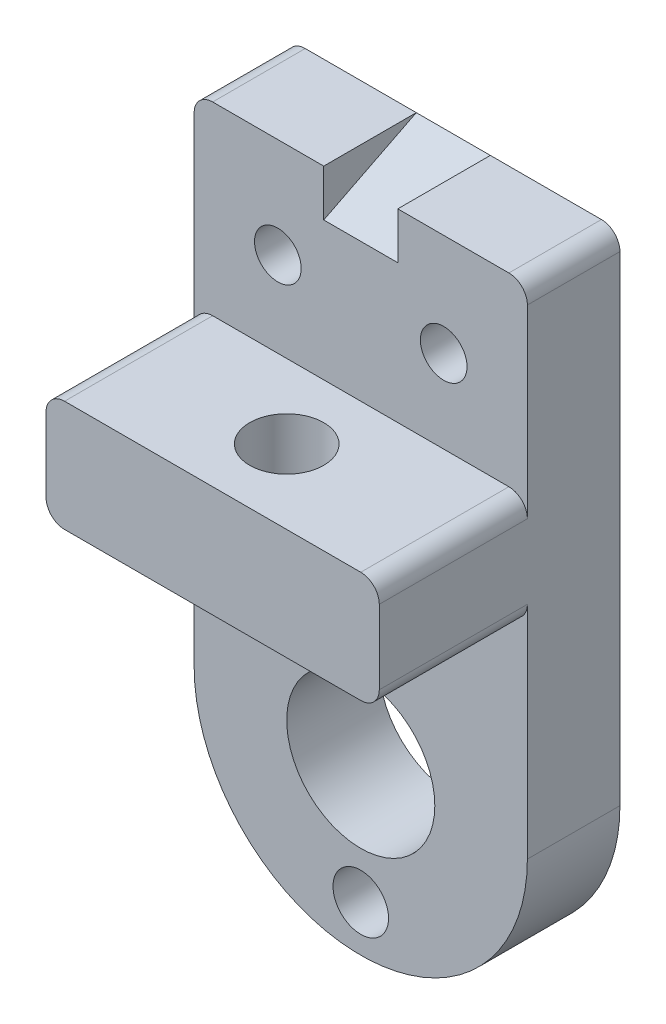
ISO-10303-21;
HEADER;
FILE_DESCRIPTION(('STEP AP214'),'2;1');
FILE_NAME('part.step','',(''),(''),'','','');
FILE_SCHEMA(('AUTOMOTIVE_DESIGN { 1 0 10303 214 1 1 1 1 }'));
ENDSEC;
DATA;
#1=APPLICATION_CONTEXT('core data for automotive mechanical design processes');
#2=APPLICATION_PROTOCOL_DEFINITION('international standard','automotive_design',2000,#1);
#3=PRODUCT_CONTEXT('',#1,'mechanical');
#4=PRODUCT('Part','Part','',(#3));
#5=PRODUCT_RELATED_PRODUCT_CATEGORY('part','',(#4));
#6=PRODUCT_DEFINITION_FORMATION('','',#4);
#7=PRODUCT_DEFINITION_CONTEXT('part definition',#1,'design');
#8=PRODUCT_DEFINITION('design','',#6,#7);
#9=PRODUCT_DEFINITION_SHAPE('','',#8);
#10=(LENGTH_UNIT() NAMED_UNIT(*) SI_UNIT(.MILLI.,.METRE.));
#11=(NAMED_UNIT(*) PLANE_ANGLE_UNIT() SI_UNIT($,.RADIAN.));
#12=(NAMED_UNIT(*) SI_UNIT($,.STERADIAN.) SOLID_ANGLE_UNIT());
#13=UNCERTAINTY_MEASURE_WITH_UNIT(LENGTH_MEASURE(1.E-05),#10,'distance_accuracy_value','');
#14=(GEOMETRIC_REPRESENTATION_CONTEXT(3) GLOBAL_UNCERTAINTY_ASSIGNED_CONTEXT((#13)) GLOBAL_UNIT_ASSIGNED_CONTEXT((#10,
#11,#12)) REPRESENTATION_CONTEXT('',''));
#15=CARTESIAN_POINT('',(0.,0.,0.));
#16=DIRECTION('',(0.,0.,1.));
#17=DIRECTION('',(1.,0.,0.));
#18=AXIS2_PLACEMENT_3D('',#15,#16,#17);
#19=CARTESIAN_POINT('',(12.7,0.,31.75));
#20=DIRECTION('',(1.,0.,0.));
#21=DIRECTION('',(0.,1.,0.));
#22=AXIS2_PLACEMENT_3D('',#19,#20,#21);
#23=PLANE('',#22);
#24=DIRECTION('',(0.,0.450068893368779,-0.892993836049165));
#25=VECTOR('',#24,1.);
#26=CARTESIAN_POINT('',(12.7,154.94,31.75));
#27=LINE('',#26,#25);
#28=CARTESIAN_POINT('',(12.7,154.94,31.75));
#29=VERTEX_POINT('',#28);
#30=CARTESIAN_POINT('',(12.7,170.942,0.));
#31=VERTEX_POINT('',#30);
#32=EDGE_CURVE('E162',#29,#31,#27,.T.);
#33=ORIENTED_EDGE('',*,*,#32,.F.);
#34=DIRECTION('',(0.,-1.,0.));
#35=VECTOR('',#34,1.);
#36=CARTESIAN_POINT('',(12.7,0.,31.75));
#37=LINE('',#36,#35);
#38=CARTESIAN_POINT('',(12.7,170.942,31.75));
#39=VERTEX_POINT('',#38);
#40=EDGE_CURVE('E172',#39,#29,#37,.T.);
#41=ORIENTED_EDGE('',*,*,#40,.F.);
#42=DIRECTION('',(0.,0.,-1.));
#43=VECTOR('',#42,1.);
#44=CARTESIAN_POINT('',(12.7,170.942,31.75));
#45=LINE('',#44,#43);
#46=EDGE_CURVE('E177',#39,#31,#45,.T.);
#47=ORIENTED_EDGE('',*,*,#46,.T.);
#48=EDGE_LOOP('',(#33,#41,#47));
#49=FACE_BOUND('',#48,.T.);
#50=ADVANCED_FACE('F41',(#49),#23,.F.);
#51=CARTESIAN_POINT('',(-12.7,0.,31.75));
#52=DIRECTION('',(1.,0.,0.));
#53=DIRECTION('',(0.,0.,-1.));
#54=AXIS2_PLACEMENT_3D('',#51,#52,#53);
#55=PLANE('',#54);
#56=DIRECTION('',(0.,-1.,0.));
#57=VECTOR('',#56,1.);
#58=CARTESIAN_POINT('',(-12.7,0.,31.75));
#59=LINE('',#58,#57);
#60=CARTESIAN_POINT('',(-12.7,170.942,31.75));
#61=VERTEX_POINT('',#60);
#62=CARTESIAN_POINT('',(-12.7,154.94,31.75));
#63=VERTEX_POINT('',#62);
#64=EDGE_CURVE('E171',#61,#63,#59,.T.);
#65=ORIENTED_EDGE('',*,*,#64,.T.);
#66=DIRECTION('',(0.,-0.450068893368779,0.892993836049165));
#67=VECTOR('',#66,1.);
#68=CARTESIAN_POINT('',(-12.7,154.94,31.75));
#69=LINE('',#68,#67);
#70=CARTESIAN_POINT('',(-12.7,170.942,0.));
#71=VERTEX_POINT('',#70);
#72=EDGE_CURVE('E165',#71,#63,#69,.T.);
#73=ORIENTED_EDGE('',*,*,#72,.F.);
#74=DIRECTION('',(0.,0.,-1.));
#75=VECTOR('',#74,1.);
#76=CARTESIAN_POINT('',(-12.7,170.942,31.75));
#77=LINE('',#76,#75);
#78=EDGE_CURVE('E196',#61,#71,#77,.T.);
#79=ORIENTED_EDGE('',*,*,#78,.F.);
#80=EDGE_LOOP('',(#65,#73,#79));
#81=FACE_BOUND('',#80,.T.);
#82=ADVANCED_FACE('F263',(#81),#55,.T.);
#83=CARTESIAN_POINT('',(0.,170.942,31.75));
#84=DIRECTION('',(0.,1.,0.));
#85=DIRECTION('',(0.,0.,1.));
#86=AXIS2_PLACEMENT_3D('',#83,#84,#85);
#87=PLANE('',#86);
#88=DIRECTION('',(1.,0.,0.));
#89=VECTOR('',#88,1.);
#90=CARTESIAN_POINT('',(0.,170.942,0.));
#91=LINE('',#90,#89);
#92=CARTESIAN_POINT('',(-50.8,170.942,0.));
#93=VERTEX_POINT('',#92);
#94=EDGE_CURVE('E206',#93,#71,#91,.T.);
#95=ORIENTED_EDGE('',*,*,#94,.F.);
#96=DIRECTION('',(0.,0.,-1.));
#97=VECTOR('',#96,1.);
#98=CARTESIAN_POINT('',(-50.8,170.942,31.75));
#99=LINE('',#98,#97);
#100=CARTESIAN_POINT('',(-50.8,170.942,31.75));
#101=VERTEX_POINT('',#100);
#102=EDGE_CURVE('E11',#101,#93,#99,.T.);
#103=ORIENTED_EDGE('',*,*,#102,.F.);
#104=DIRECTION('',(1.,0.,0.));
#105=VECTOR('',#104,1.);
#106=CARTESIAN_POINT('',(0.,170.942,31.75));
#107=LINE('',#106,#105);
#108=EDGE_CURVE('E261',#101,#61,#107,.T.);
#109=ORIENTED_EDGE('',*,*,#108,.T.);
#110=ORIENTED_EDGE('',*,*,#78,.T.);
#111=EDGE_LOOP('',(#95,#103,#109,#110));
#112=FACE_BOUND('',#111,.T.);
#113=ADVANCED_FACE('F259',(#112),#87,.T.);
#114=CARTESIAN_POINT('',(-50.8,164.592,31.75));
#115=DIRECTION('',(0.,0.,-1.));
#116=DIRECTION('',(-1.,0.,0.));
#117=AXIS2_PLACEMENT_3D('',#114,#115,#116);
#118=CYLINDRICAL_SURFACE('',#117,6.35);
#119=CARTESIAN_POINT('',(-50.8,164.592,0.));
#120=DIRECTION('',(0.,0.,1.));
#121=DIRECTION('',(1.,0.,0.));
#122=AXIS2_PLACEMENT_3D('',#119,#120,#121);
#123=CIRCLE('',#122,6.35);
#124=CARTESIAN_POINT('',(-57.15,164.592,0.));
#125=VERTEX_POINT('',#124);
#126=EDGE_CURVE('E210',#93,#125,#123,.T.);
#127=ORIENTED_EDGE('',*,*,#126,.T.);
#128=DIRECTION('',(0.,0.,-1.));
#129=VECTOR('',#128,1.);
#130=CARTESIAN_POINT('',(-57.15,164.592,31.75));
#131=LINE('',#130,#129);
#132=CARTESIAN_POINT('',(-57.15,164.592,31.75));
#133=VERTEX_POINT('',#132);
#134=EDGE_CURVE('E50',#133,#125,#131,.T.);
#135=ORIENTED_EDGE('',*,*,#134,.F.);
#136=CARTESIAN_POINT('',(-50.8,164.592,31.75));
#137=DIRECTION('',(0.,0.,1.));
#138=DIRECTION('',(1.,0.,0.));
#139=AXIS2_PLACEMENT_3D('',#136,#137,#138);
#140=CIRCLE('',#139,6.35);
#141=EDGE_CURVE('E394',#101,#133,#140,.T.);
#142=ORIENTED_EDGE('',*,*,#141,.F.);
#143=ORIENTED_EDGE('',*,*,#102,.T.);
#144=EDGE_LOOP('',(#127,#135,#142,#143));
#145=FACE_BOUND('',#144,.T.);
#146=ADVANCED_FACE('F252',(#145),#118,.T.);
#147=CARTESIAN_POINT('',(-57.15,0.,31.75));
#148=DIRECTION('',(1.,0.,0.));
#149=DIRECTION('',(0.,1.,0.));
#150=AXIS2_PLACEMENT_3D('',#147,#148,#149);
#151=PLANE('',#150);
#152=DIRECTION('',(0.,-1.,0.));
#153=VECTOR('',#152,1.);
#154=CARTESIAN_POINT('',(-57.15,0.,0.));
#155=LINE('',#154,#153);
#156=CARTESIAN_POINT('',(-57.15,0.,0.));
#157=VERTEX_POINT('',#156);
#158=EDGE_CURVE('E214',#125,#157,#155,.T.);
#159=ORIENTED_EDGE('',*,*,#158,.T.);
#160=DIRECTION('',(0.,0.,-1.));
#161=VECTOR('',#160,1.);
#162=CARTESIAN_POINT('',(-57.15,0.,31.75));
#163=LINE('',#162,#161);
#164=CARTESIAN_POINT('',(-57.15,0.,31.75));
#165=VERTEX_POINT('',#164);
#166=EDGE_CURVE('E327',#165,#157,#163,.T.);
#167=ORIENTED_EDGE('',*,*,#166,.F.);
#168=DIRECTION('',(0.,-1.,0.));
#169=VECTOR('',#168,1.);
#170=CARTESIAN_POINT('',(-57.15,0.,31.75));
#171=LINE('',#170,#169);
#172=CARTESIAN_POINT('',(-57.15,75.6920000000001,31.75));
#173=VERTEX_POINT('',#172);
#174=EDGE_CURVE('E287',#173,#165,#171,.T.);
#175=ORIENTED_EDGE('',*,*,#174,.F.);
#176=DIRECTION('',(0.,0.,-1.));
#177=VECTOR('',#176,1.);
#178=CARTESIAN_POINT('',(-57.15,75.6920000000001,82.55));
#179=LINE('',#178,#177);
#180=CARTESIAN_POINT('',(-57.15,75.6920000000001,82.55));
#181=VERTEX_POINT('',#180);
#182=EDGE_CURVE('E57',#181,#173,#179,.T.);
#183=ORIENTED_EDGE('',*,*,#182,.F.);
#184=DIRECTION('',(0.,-1.,0.));
#185=VECTOR('',#184,1.);
#186=CARTESIAN_POINT('',(-57.15,0.,82.55));
#187=LINE('',#186,#185);
#188=CARTESIAN_POINT('',(-57.15,101.092,82.55));
#189=VERTEX_POINT('',#188);
#190=EDGE_CURVE('E342',#189,#181,#187,.T.);
#191=ORIENTED_EDGE('',*,*,#190,.F.);
#192=DIRECTION('',(0.,0.,-1.));
#193=VECTOR('',#192,1.);
#194=CARTESIAN_POINT('',(-57.15,101.092,82.55));
#195=LINE('',#194,#193);
#196=CARTESIAN_POINT('',(-57.15,101.092,31.75));
#197=VERTEX_POINT('',#196);
#198=EDGE_CURVE('E375',#189,#197,#195,.T.);
#199=ORIENTED_EDGE('',*,*,#198,.T.);
#200=DIRECTION('',(0.,-1.,0.));
#201=VECTOR('',#200,1.);
#202=CARTESIAN_POINT('',(-57.15,0.,31.75));
#203=LINE('',#202,#201);
#204=EDGE_CURVE('E247',#133,#197,#203,.T.);
#205=ORIENTED_EDGE('',*,*,#204,.F.);
#206=ORIENTED_EDGE('',*,*,#134,.T.);
#207=EDGE_LOOP('',(#159,#167,#175,#183,#191,#199,#205,#206));
#208=FACE_BOUND('',#207,.T.);
#209=ADVANCED_FACE('F243',(#208),#151,.F.);
#210=CARTESIAN_POINT('',(57.15,0.,31.75));
#211=DIRECTION('',(1.,0.,0.));
#212=DIRECTION('',(0.,1.,0.));
#213=AXIS2_PLACEMENT_3D('',#210,#211,#212);
#214=PLANE('',#213);
#215=DIRECTION('',(0.,-1.,0.));
#216=VECTOR('',#215,1.);
#217=CARTESIAN_POINT('',(57.15,0.,0.));
#218=LINE('',#217,#216);
#219=CARTESIAN_POINT('',(57.15,164.592,0.));
#220=VERTEX_POINT('',#219);
#221=CARTESIAN_POINT('',(57.15,0.,0.));
#222=VERTEX_POINT('',#221);
#223=EDGE_CURVE('E217',#220,#222,#218,.T.);
#224=ORIENTED_EDGE('',*,*,#223,.F.);
#225=DIRECTION('',(0.,0.,-1.));
#226=VECTOR('',#225,1.);
#227=CARTESIAN_POINT('',(57.15,164.592,31.75));
#228=LINE('',#227,#226);
#229=CARTESIAN_POINT('',(57.15,164.592,31.75));
#230=VERTEX_POINT('',#229);
#231=EDGE_CURVE('E237',#230,#220,#228,.T.);
#232=ORIENTED_EDGE('',*,*,#231,.F.);
#233=DIRECTION('',(0.,-1.,0.));
#234=VECTOR('',#233,1.);
#235=CARTESIAN_POINT('',(57.15,0.,31.75));
#236=LINE('',#235,#234);
#237=CARTESIAN_POINT('',(57.15,101.092,31.75));
#238=VERTEX_POINT('',#237);
#239=EDGE_CURVE('E408',#230,#238,#236,.T.);
#240=ORIENTED_EDGE('',*,*,#239,.T.);
#241=DIRECTION('',(0.,0.,-1.));
#242=VECTOR('',#241,1.);
#243=CARTESIAN_POINT('',(57.15,101.092,82.55));
#244=LINE('',#243,#242);
#245=CARTESIAN_POINT('',(57.15,101.092,82.55));
#246=VERTEX_POINT('',#245);
#247=EDGE_CURVE('E358',#246,#238,#244,.T.);
#248=ORIENTED_EDGE('',*,*,#247,.F.);
#249=DIRECTION('',(0.,-1.,0.));
#250=VECTOR('',#249,1.);
#251=CARTESIAN_POINT('',(57.15,0.,82.55));
#252=LINE('',#251,#250);
#253=CARTESIAN_POINT('',(57.15,75.6920000000001,82.55));
#254=VERTEX_POINT('',#253);
#255=EDGE_CURVE('E354',#246,#254,#252,.T.);
#256=ORIENTED_EDGE('',*,*,#255,.T.);
#257=DIRECTION('',(0.,0.,-1.));
#258=VECTOR('',#257,1.);
#259=CARTESIAN_POINT('',(57.15,75.6920000000001,82.55));
#260=LINE('',#259,#258);
#261=CARTESIAN_POINT('',(57.15,75.6920000000001,31.75));
#262=VERTEX_POINT('',#261);
#263=EDGE_CURVE('E362',#254,#262,#260,.T.);
#264=ORIENTED_EDGE('',*,*,#263,.T.);
#265=DIRECTION('',(0.,-1.,0.));
#266=VECTOR('',#265,1.);
#267=CARTESIAN_POINT('',(57.15,0.,31.75));
#268=LINE('',#267,#266);
#269=CARTESIAN_POINT('',(57.15,0.,31.75));
#270=VERTEX_POINT('',#269);
#271=EDGE_CURVE('E293',#262,#270,#268,.T.);
#272=ORIENTED_EDGE('',*,*,#271,.T.);
#273=DIRECTION('',(0.,0.,-1.));
#274=VECTOR('',#273,1.);
#275=CARTESIAN_POINT('',(57.15,0.,31.75));
#276=LINE('',#275,#274);
#277=EDGE_CURVE('E309',#270,#222,#276,.T.);
#278=ORIENTED_EDGE('',*,*,#277,.T.);
#279=EDGE_LOOP('',(#224,#232,#240,#248,#256,#264,#272,#278));
#280=FACE_BOUND('',#279,.T.);
#281=ADVANCED_FACE('F422',(#280),#214,.T.);
#282=CARTESIAN_POINT('',(50.8,164.592,31.75));
#283=DIRECTION('',(0.,0.,-1.));
#284=DIRECTION('',(-1.,0.,0.));
#285=AXIS2_PLACEMENT_3D('',#282,#283,#284);
#286=CYLINDRICAL_SURFACE('',#285,6.35);
#287=CARTESIAN_POINT('',(50.8,164.592,0.));
#288=DIRECTION('',(0.,0.,1.));
#289=DIRECTION('',(1.,0.,0.));
#290=AXIS2_PLACEMENT_3D('',#287,#288,#289);
#291=CIRCLE('',#290,6.35);
#292=CARTESIAN_POINT('',(50.8,170.942,0.));
#293=VERTEX_POINT('',#292);
#294=EDGE_CURVE('E220',#293,#220,#291,.F.);
#295=ORIENTED_EDGE('',*,*,#294,.F.);
#296=DIRECTION('',(0.,0.,-1.));
#297=VECTOR('',#296,1.);
#298=CARTESIAN_POINT('',(50.8,170.942,31.75));
#299=LINE('',#298,#297);
#300=CARTESIAN_POINT('',(50.8,170.942,31.75));
#301=VERTEX_POINT('',#300);
#302=EDGE_CURVE('E234',#301,#293,#299,.T.);
#303=ORIENTED_EDGE('',*,*,#302,.F.);
#304=CARTESIAN_POINT('',(50.8,164.592,31.75));
#305=DIRECTION('',(0.,0.,1.));
#306=DIRECTION('',(1.,0.,0.));
#307=AXIS2_PLACEMENT_3D('',#304,#305,#306);
#308=CIRCLE('',#307,6.35);
#309=EDGE_CURVE('E190',#301,#230,#308,.F.);
#310=ORIENTED_EDGE('',*,*,#309,.T.);
#311=ORIENTED_EDGE('',*,*,#231,.T.);
#312=EDGE_LOOP('',(#295,#303,#310,#311));
#313=FACE_BOUND('',#312,.T.);
#314=ADVANCED_FACE('F415',(#313),#286,.T.);
#315=CARTESIAN_POINT('',(0.,170.942,31.75));
#316=DIRECTION('',(0.,1.,0.));
#317=DIRECTION('',(0.,0.,1.));
#318=AXIS2_PLACEMENT_3D('',#315,#316,#317);
#319=PLANE('',#318);
#320=DIRECTION('',(1.,0.,0.));
#321=VECTOR('',#320,1.);
#322=CARTESIAN_POINT('',(0.,170.942,0.));
#323=LINE('',#322,#321);
#324=EDGE_CURVE('E224',#31,#293,#323,.T.);
#325=ORIENTED_EDGE('',*,*,#324,.F.);
#326=ORIENTED_EDGE('',*,*,#46,.F.);
#327=DIRECTION('',(1.,0.,0.));
#328=VECTOR('',#327,1.);
#329=CARTESIAN_POINT('',(0.,170.942,31.75));
#330=LINE('',#329,#328);
#331=EDGE_CURVE('E186',#39,#301,#330,.T.);
#332=ORIENTED_EDGE('',*,*,#331,.T.);
#333=ORIENTED_EDGE('',*,*,#302,.T.);
#334=EDGE_LOOP('',(#325,#326,#332,#333));
#335=FACE_BOUND('',#334,.T.);
#336=ADVANCED_FACE('F419',(#335),#319,.T.);
#337=CARTESIAN_POINT('',(-28.448,136.652,31.75));
#338=DIRECTION('',(0.,0.,-1.));
#339=DIRECTION('',(-1.,0.,0.));
#340=AXIS2_PLACEMENT_3D('',#337,#338,#339);
#341=CYLINDRICAL_SURFACE('',#340,8.001);
#342=CARTESIAN_POINT('',(-28.448,136.652,31.75));
#343=DIRECTION('',(0.,0.,1.));
#344=DIRECTION('',(1.,0.,0.));
#345=AXIS2_PLACEMENT_3D('',#342,#343,#344);
#346=CIRCLE('',#345,8.001);
#347=CARTESIAN_POINT('',(-20.447,136.652,31.75));
#348=VERTEX_POINT('',#347);
#349=EDGE_CURVE('E388',#348,#348,#346,.T.);
#350=ORIENTED_EDGE('',*,*,#349,.T.);
#351=EDGE_LOOP('',(#350));
#352=FACE_BOUND('',#351,.T.);
#353=CARTESIAN_POINT('',(-28.448,136.652,0.));
#354=DIRECTION('',(0.,0.,1.));
#355=DIRECTION('',(1.,0.,0.));
#356=AXIS2_PLACEMENT_3D('',#353,#354,#355);
#357=CIRCLE('',#356,8.001);
#358=CARTESIAN_POINT('',(-20.447,136.652,0.));
#359=VERTEX_POINT('',#358);
#360=EDGE_CURVE('E201',#359,#359,#357,.T.);
#361=ORIENTED_EDGE('',*,*,#360,.F.);
#362=EDGE_LOOP('',(#361));
#363=FACE_BOUND('',#362,.T.);
#364=ADVANCED_FACE('F471',(#352,#363),#341,.F.);
#365=CARTESIAN_POINT('',(28.448,135.89,31.75));
#366=DIRECTION('',(0.,0.,-1.));
#367=DIRECTION('',(-1.,0.,0.));
#368=AXIS2_PLACEMENT_3D('',#365,#366,#367);
#369=CYLINDRICAL_SURFACE('',#368,8.001);
#370=CARTESIAN_POINT('',(28.448,135.89,31.75));
#371=DIRECTION('',(0.,0.,1.));
#372=DIRECTION('',(1.,0.,0.));
#373=AXIS2_PLACEMENT_3D('',#370,#371,#372);
#374=CIRCLE('',#373,8.001);
#375=CARTESIAN_POINT('',(36.449,135.89,31.75));
#376=VERTEX_POINT('',#375);
#377=EDGE_CURVE('E228',#376,#376,#374,.T.);
#378=ORIENTED_EDGE('',*,*,#377,.T.);
#379=EDGE_LOOP('',(#378));
#380=FACE_BOUND('',#379,.T.);
#381=CARTESIAN_POINT('',(28.448,135.89,0.));
#382=DIRECTION('',(0.,0.,1.));
#383=DIRECTION('',(1.,0.,0.));
#384=AXIS2_PLACEMENT_3D('',#381,#382,#383);
#385=CIRCLE('',#384,8.001);
#386=CARTESIAN_POINT('',(36.449,135.89,0.));
#387=VERTEX_POINT('',#386);
#388=EDGE_CURVE('E197',#387,#387,#385,.T.);
#389=ORIENTED_EDGE('',*,*,#388,.F.);
#390=EDGE_LOOP('',(#389));
#391=FACE_BOUND('',#390,.T.);
#392=ADVANCED_FACE('F43',(#380,#391),#369,.F.);
#393=CARTESIAN_POINT('',(0.,0.,31.75));
#394=DIRECTION('',(0.,0.,1.));
#395=DIRECTION('',(1.,0.,0.));
#396=AXIS2_PLACEMENT_3D('',#393,#394,#395);
#397=PLANE('',#396);
#398=ORIENTED_EDGE('',*,*,#377,.F.);
#399=EDGE_LOOP('',(#398));
#400=FACE_BOUND('',#399,.T.);
#401=ORIENTED_EDGE('',*,*,#349,.F.);
#402=EDGE_LOOP('',(#401));
#403=FACE_BOUND('',#402,.T.);
#404=ORIENTED_EDGE('',*,*,#108,.F.);
#405=ORIENTED_EDGE('',*,*,#141,.T.);
#406=ORIENTED_EDGE('',*,*,#204,.T.);
#407=CARTESIAN_POINT('',(-50.8,101.092,31.75));
#408=DIRECTION('',(0.,0.,1.));
#409=DIRECTION('',(1.,0.,0.));
#410=AXIS2_PLACEMENT_3D('',#407,#408,#409);
#411=CIRCLE('',#410,6.34999999999999);
#412=CARTESIAN_POINT('',(-50.8,107.442,31.75));
#413=VERTEX_POINT('',#412);
#414=EDGE_CURVE('E399',#197,#413,#411,.F.);
#415=ORIENTED_EDGE('',*,*,#414,.T.);
#416=DIRECTION('',(1.,0.,0.));
#417=VECTOR('',#416,1.);
#418=CARTESIAN_POINT('',(0.,107.442,31.75));
#419=LINE('',#418,#417);
#420=CARTESIAN_POINT('',(50.8,107.442,31.75));
#421=VERTEX_POINT('',#420);
#422=EDGE_CURVE('E402',#413,#421,#419,.T.);
#423=ORIENTED_EDGE('',*,*,#422,.T.);
#424=CARTESIAN_POINT('',(50.8,101.092,31.75));
#425=DIRECTION('',(0.,0.,1.));
#426=DIRECTION('',(1.,0.,0.));
#427=AXIS2_PLACEMENT_3D('',#424,#425,#426);
#428=CIRCLE('',#427,6.34999999999999);
#429=EDGE_CURVE('E405',#421,#238,#428,.F.);
#430=ORIENTED_EDGE('',*,*,#429,.T.);
#431=ORIENTED_EDGE('',*,*,#239,.F.);
#432=ORIENTED_EDGE('',*,*,#309,.F.);
#433=ORIENTED_EDGE('',*,*,#331,.F.);
#434=ORIENTED_EDGE('',*,*,#40,.T.);
#435=DIRECTION('',(1.,0.,0.));
#436=VECTOR('',#435,1.);
#437=CARTESIAN_POINT('',(0.,154.94,31.75));
#438=LINE('',#437,#436);
#439=EDGE_CURVE('E159',#63,#29,#438,.T.);
#440=ORIENTED_EDGE('',*,*,#439,.F.);
#441=ORIENTED_EDGE('',*,*,#64,.F.);
#442=EDGE_LOOP('',(#404,#405,#406,#415,#423,#430,#431,#432,#433,#434,#440,#441));
#443=FACE_BOUND('',#442,.T.);
#444=ADVANCED_FACE('F183',(#400,#403,#443),#397,.T.);
#445=CARTESIAN_POINT('',(0.,0.,0.));
#446=DIRECTION('',(0.,0.,1.));
#447=DIRECTION('',(1.,0.,0.));
#448=AXIS2_PLACEMENT_3D('',#445,#446,#447);
#449=PLANE('',#448);
#450=CARTESIAN_POINT('',(0.,0.,0.));
#451=DIRECTION('',(0.,0.,1.));
#452=DIRECTION('',(1.,0.,0.));
#453=AXIS2_PLACEMENT_3D('',#450,#451,#452);
#454=CIRCLE('',#453,57.15);
#455=EDGE_CURVE('E277',#157,#222,#454,.T.);
#456=ORIENTED_EDGE('',*,*,#455,.F.);
#457=ORIENTED_EDGE('',*,*,#158,.F.);
#458=ORIENTED_EDGE('',*,*,#126,.F.);
#459=ORIENTED_EDGE('',*,*,#94,.T.);
#460=DIRECTION('',(1.,0.,0.));
#461=VECTOR('',#460,1.);
#462=CARTESIAN_POINT('',(-57.152,170.942,0.));
#463=LINE('',#462,#461);
#464=EDGE_CURVE('E180',#71,#31,#463,.T.);
#465=ORIENTED_EDGE('',*,*,#464,.T.);
#466=ORIENTED_EDGE('',*,*,#324,.T.);
#467=ORIENTED_EDGE('',*,*,#294,.T.);
#468=ORIENTED_EDGE('',*,*,#223,.T.);
#469=EDGE_LOOP('',(#456,#457,#458,#459,#465,#466,#467,#468));
#470=FACE_BOUND('',#469,.T.);
#471=ORIENTED_EDGE('',*,*,#388,.T.);
#472=EDGE_LOOP('',(#471));
#473=FACE_BOUND('',#472,.T.);
#474=ORIENTED_EDGE('',*,*,#360,.T.);
#475=EDGE_LOOP('',(#474));
#476=FACE_BOUND('',#475,.T.);
#477=CARTESIAN_POINT('',(0.,-41.402,0.));
#478=DIRECTION('',(0.,0.,1.));
#479=DIRECTION('',(1.,0.,0.));
#480=AXIS2_PLACEMENT_3D('',#477,#478,#479);
#481=CIRCLE('',#480,9.525);
#482=CARTESIAN_POINT('',(9.525,-41.402,0.));
#483=VERTEX_POINT('',#482);
#484=EDGE_CURVE('E313',#483,#483,#481,.T.);
#485=ORIENTED_EDGE('',*,*,#484,.T.);
#486=EDGE_LOOP('',(#485));
#487=FACE_BOUND('',#486,.T.);
#488=CARTESIAN_POINT('',(-28.702,41.402,0.));
#489=DIRECTION('',(0.,0.,1.));
#490=DIRECTION('',(1.,0.,0.));
#491=AXIS2_PLACEMENT_3D('',#488,#489,#490);
#492=CIRCLE('',#491,6.35);
#493=CARTESIAN_POINT('',(-22.352,41.402,0.));
#494=VERTEX_POINT('',#493);
#495=EDGE_CURVE('E317',#494,#494,#492,.T.);
#496=ORIENTED_EDGE('',*,*,#495,.T.);
#497=EDGE_LOOP('',(#496));
#498=FACE_BOUND('',#497,.T.);
#499=CARTESIAN_POINT('',(0.,0.,0.));
#500=DIRECTION('',(0.,0.,1.));
#501=DIRECTION('',(1.,0.,0.));
#502=AXIS2_PLACEMENT_3D('',#499,#500,#501);
#503=CIRCLE('',#502,25.4);
#504=CARTESIAN_POINT('',(25.4,0.,0.));
#505=VERTEX_POINT('',#504);
#506=EDGE_CURVE('E282',#505,#505,#503,.T.);
#507=ORIENTED_EDGE('',*,*,#506,.T.);
#508=EDGE_LOOP('',(#507));
#509=FACE_BOUND('',#508,.T.);
#510=ADVANCED_FACE('F256',(#470,#473,#476,#487,#498,#509),#449,.F.);
#511=CARTESIAN_POINT('',(50.8,101.092,82.55));
#512=DIRECTION('',(0.,0.,-1.));
#513=DIRECTION('',(-1.,0.,0.));
#514=AXIS2_PLACEMENT_3D('',#511,#512,#513);
#515=CYLINDRICAL_SURFACE('',#514,6.34999999999999);
#516=ORIENTED_EDGE('',*,*,#247,.T.);
#517=ORIENTED_EDGE('',*,*,#429,.F.);
#518=DIRECTION('',(0.,0.,-1.));
#519=VECTOR('',#518,1.);
#520=CARTESIAN_POINT('',(50.8,107.442,82.55));
#521=LINE('',#520,#519);
#522=CARTESIAN_POINT('',(50.8,107.442,82.55));
#523=VERTEX_POINT('',#522);
#524=EDGE_CURVE('E202',#523,#421,#521,.T.);
#525=ORIENTED_EDGE('',*,*,#524,.F.);
#526=CARTESIAN_POINT('',(50.8,101.092,82.55));
#527=DIRECTION('',(0.,0.,1.));
#528=DIRECTION('',(1.,0.,0.));
#529=AXIS2_PLACEMENT_3D('',#526,#527,#528);
#530=CIRCLE('',#529,6.34999999999999);
#531=EDGE_CURVE('E330',#523,#246,#530,.F.);
#532=ORIENTED_EDGE('',*,*,#531,.T.);
#533=EDGE_LOOP('',(#516,#517,#525,#532));
#534=FACE_BOUND('',#533,.T.);
#535=ADVANCED_FACE('F493',(#534),#515,.T.);
#536=CARTESIAN_POINT('',(0.,107.442,82.55));
#537=DIRECTION('',(0.,1.,0.));
#538=DIRECTION('',(0.,0.,1.));
#539=AXIS2_PLACEMENT_3D('',#536,#537,#538);
#540=PLANE('',#539);
#541=CARTESIAN_POINT('',(0.,107.442,57.15));
#542=DIRECTION('',(0.,1.,0.));
#543=DIRECTION('',(0.,0.,1.));
#544=AXIS2_PLACEMENT_3D('',#541,#542,#543);
#545=CIRCLE('',#544,12.7);
#546=CARTESIAN_POINT('',(0.,107.442,69.85));
#547=VERTEX_POINT('',#546);
#548=EDGE_CURVE('E265',#547,#547,#545,.T.);
#549=ORIENTED_EDGE('',*,*,#548,.F.);
#550=EDGE_LOOP('',(#549));
#551=FACE_BOUND('',#550,.T.);
#552=ORIENTED_EDGE('',*,*,#524,.T.);
#553=ORIENTED_EDGE('',*,*,#422,.F.);
#554=DIRECTION('',(0.,0.,-1.));
#555=VECTOR('',#554,1.);
#556=CARTESIAN_POINT('',(-50.8,107.442,82.55));
#557=LINE('',#556,#555);
#558=CARTESIAN_POINT('',(-50.8,107.442,82.55));
#559=VERTEX_POINT('',#558);
#560=EDGE_CURVE('E378',#559,#413,#557,.T.);
#561=ORIENTED_EDGE('',*,*,#560,.F.);
#562=DIRECTION('',(1.,0.,0.));
#563=VECTOR('',#562,1.);
#564=CARTESIAN_POINT('',(0.,107.442,82.55));
#565=LINE('',#564,#563);
#566=EDGE_CURVE('E334',#559,#523,#565,.T.);
#567=ORIENTED_EDGE('',*,*,#566,.T.);
#568=EDGE_LOOP('',(#552,#553,#561,#567));
#569=FACE_BOUND('',#568,.T.);
#570=ADVANCED_FACE('F458',(#551,#569),#540,.T.);
#571=CARTESIAN_POINT('',(-50.8,101.092,82.55));
#572=DIRECTION('',(0.,0.,-1.));
#573=DIRECTION('',(-1.,0.,0.));
#574=AXIS2_PLACEMENT_3D('',#571,#572,#573);
#575=CYLINDRICAL_SURFACE('',#574,6.34999999999999);
#576=ORIENTED_EDGE('',*,*,#560,.T.);
#577=ORIENTED_EDGE('',*,*,#414,.F.);
#578=ORIENTED_EDGE('',*,*,#198,.F.);
#579=CARTESIAN_POINT('',(-50.8,101.092,82.55));
#580=DIRECTION('',(0.,0.,1.));
#581=DIRECTION('',(1.,0.,0.));
#582=AXIS2_PLACEMENT_3D('',#579,#580,#581);
#583=CIRCLE('',#582,6.34999999999999);
#584=EDGE_CURVE('E338',#189,#559,#583,.F.);
#585=ORIENTED_EDGE('',*,*,#584,.T.);
#586=EDGE_LOOP('',(#576,#577,#578,#585));
#587=FACE_BOUND('',#586,.T.);
#588=ADVANCED_FACE('F450',(#587),#575,.T.);
#589=CARTESIAN_POINT('',(-50.8,75.692,82.55));
#590=DIRECTION('',(0.,0.,-1.));
#591=DIRECTION('',(-1.,0.,0.));
#592=AXIS2_PLACEMENT_3D('',#589,#590,#591);
#593=CYLINDRICAL_SURFACE('',#592,6.34999999999999);
#594=CARTESIAN_POINT('',(-50.8,75.692,31.75));
#595=DIRECTION('',(0.,0.,1.));
#596=DIRECTION('',(1.,0.,0.));
#597=AXIS2_PLACEMENT_3D('',#594,#595,#596);
#598=CIRCLE('',#597,6.34999999999999);
#599=CARTESIAN_POINT('',(-50.8,69.342,31.75));
#600=VERTEX_POINT('',#599);
#601=EDGE_CURVE('E61',#600,#173,#598,.F.);
#602=ORIENTED_EDGE('',*,*,#601,.F.);
#603=DIRECTION('',(0.,0.,-1.));
#604=VECTOR('',#603,1.);
#605=CARTESIAN_POINT('',(-50.8,69.342,82.55));
#606=LINE('',#605,#604);
#607=CARTESIAN_POINT('',(-50.8,69.342,82.55));
#608=VERTEX_POINT('',#607);
#609=EDGE_CURVE('E370',#608,#600,#606,.T.);
#610=ORIENTED_EDGE('',*,*,#609,.F.);
#611=CARTESIAN_POINT('',(-50.8,75.692,82.55));
#612=DIRECTION('',(0.,0.,1.));
#613=DIRECTION('',(1.,0.,0.));
#614=AXIS2_PLACEMENT_3D('',#611,#612,#613);
#615=CIRCLE('',#614,6.34999999999999);
#616=EDGE_CURVE('E345',#608,#181,#615,.F.);
#617=ORIENTED_EDGE('',*,*,#616,.T.);
#618=ORIENTED_EDGE('',*,*,#182,.T.);
#619=EDGE_LOOP('',(#602,#610,#617,#618));
#620=FACE_BOUND('',#619,.T.);
#621=ADVANCED_FACE('F448',(#620),#593,.T.);
#622=CARTESIAN_POINT('',(0.,69.342,82.55));
#623=DIRECTION('',(0.,1.,0.));
#624=DIRECTION('',(0.,0.,1.));
#625=AXIS2_PLACEMENT_3D('',#622,#623,#624);
#626=PLANE('',#625);
#627=CARTESIAN_POINT('',(0.,69.342,57.15));
#628=DIRECTION('',(0.,1.,0.));
#629=DIRECTION('',(0.,0.,1.));
#630=AXIS2_PLACEMENT_3D('',#627,#628,#629);
#631=CIRCLE('',#630,12.7);
#632=CARTESIAN_POINT('',(0.,69.342,69.85));
#633=VERTEX_POINT('',#632);
#634=EDGE_CURVE('E270',#633,#633,#631,.F.);
#635=ORIENTED_EDGE('',*,*,#634,.F.);
#636=EDGE_LOOP('',(#635));
#637=FACE_BOUND('',#636,.T.);
#638=ORIENTED_EDGE('',*,*,#609,.T.);
#639=DIRECTION('',(1.,0.,0.));
#640=VECTOR('',#639,1.);
#641=CARTESIAN_POINT('',(0.,69.342,31.75));
#642=LINE('',#641,#640);
#643=CARTESIAN_POINT('',(50.8,69.342,31.75));
#644=VERTEX_POINT('',#643);
#645=EDGE_CURVE('E281',#600,#644,#642,.T.);
#646=ORIENTED_EDGE('',*,*,#645,.T.);
#647=DIRECTION('',(0.,0.,-1.));
#648=VECTOR('',#647,1.);
#649=CARTESIAN_POINT('',(50.8,69.342,82.55));
#650=LINE('',#649,#648);
#651=CARTESIAN_POINT('',(50.8,69.342,82.55));
#652=VERTEX_POINT('',#651);
#653=EDGE_CURVE('E366',#652,#644,#650,.T.);
#654=ORIENTED_EDGE('',*,*,#653,.F.);
#655=DIRECTION('',(1.,0.,0.));
#656=VECTOR('',#655,1.);
#657=CARTESIAN_POINT('',(0.,69.342,82.55));
#658=LINE('',#657,#656);
#659=EDGE_CURVE('E348',#608,#652,#658,.T.);
#660=ORIENTED_EDGE('',*,*,#659,.F.);
#661=EDGE_LOOP('',(#638,#646,#654,#660));
#662=FACE_BOUND('',#661,.T.);
#663=ADVANCED_FACE('F436',(#637,#662),#626,.F.);
#664=CARTESIAN_POINT('',(50.8,75.692,82.55));
#665=DIRECTION('',(0.,0.,-1.));
#666=DIRECTION('',(-1.,0.,0.));
#667=AXIS2_PLACEMENT_3D('',#664,#665,#666);
#668=CYLINDRICAL_SURFACE('',#667,6.34999999999999);
#669=ORIENTED_EDGE('',*,*,#653,.T.);
#670=CARTESIAN_POINT('',(50.8,75.692,31.75));
#671=DIRECTION('',(0.,0.,1.));
#672=DIRECTION('',(1.,0.,0.));
#673=AXIS2_PLACEMENT_3D('',#670,#671,#672);
#674=CIRCLE('',#673,6.34999999999999);
#675=EDGE_CURVE('E278',#644,#262,#674,.T.);
#676=ORIENTED_EDGE('',*,*,#675,.T.);
#677=ORIENTED_EDGE('',*,*,#263,.F.);
#678=CARTESIAN_POINT('',(50.8,75.692,82.55));
#679=DIRECTION('',(0.,0.,1.));
#680=DIRECTION('',(1.,0.,0.));
#681=AXIS2_PLACEMENT_3D('',#678,#679,#680);
#682=CIRCLE('',#681,6.34999999999999);
#683=EDGE_CURVE('E351',#652,#254,#682,.T.);
#684=ORIENTED_EDGE('',*,*,#683,.F.);
#685=EDGE_LOOP('',(#669,#676,#677,#684));
#686=FACE_BOUND('',#685,.T.);
#687=ADVANCED_FACE('F440',(#686),#668,.T.);
#688=CARTESIAN_POINT('',(0.,0.,82.55));
#689=DIRECTION('',(0.,0.,1.));
#690=DIRECTION('',(1.,0.,0.));
#691=AXIS2_PLACEMENT_3D('',#688,#689,#690);
#692=PLANE('',#691);
#693=ORIENTED_EDGE('',*,*,#531,.F.);
#694=ORIENTED_EDGE('',*,*,#566,.F.);
#695=ORIENTED_EDGE('',*,*,#584,.F.);
#696=ORIENTED_EDGE('',*,*,#190,.T.);
#697=ORIENTED_EDGE('',*,*,#616,.F.);
#698=ORIENTED_EDGE('',*,*,#659,.T.);
#699=ORIENTED_EDGE('',*,*,#683,.T.);
#700=ORIENTED_EDGE('',*,*,#255,.F.);
#701=EDGE_LOOP('',(#693,#694,#695,#696,#697,#698,#699,#700));
#702=FACE_BOUND('',#701,.T.);
#703=ADVANCED_FACE('F445',(#702),#692,.T.);
#704=CARTESIAN_POINT('',(0.,0.,31.75));
#705=DIRECTION('',(0.,0.,-1.));
#706=DIRECTION('',(-1.,0.,0.));
#707=AXIS2_PLACEMENT_3D('',#704,#705,#706);
#708=CYLINDRICAL_SURFACE('',#707,57.15);
#709=ORIENTED_EDGE('',*,*,#455,.T.);
#710=ORIENTED_EDGE('',*,*,#277,.F.);
#711=CARTESIAN_POINT('',(0.,0.,31.75));
#712=DIRECTION('',(0.,0.,1.));
#713=DIRECTION('',(1.,0.,0.));
#714=AXIS2_PLACEMENT_3D('',#711,#712,#713);
#715=CIRCLE('',#714,57.15);
#716=EDGE_CURVE('E290',#165,#270,#715,.T.);
#717=ORIENTED_EDGE('',*,*,#716,.F.);
#718=ORIENTED_EDGE('',*,*,#166,.T.);
#719=EDGE_LOOP('',(#709,#710,#717,#718));
#720=FACE_BOUND('',#719,.T.);
#721=ADVANCED_FACE('F426',(#720),#708,.T.);
#722=CARTESIAN_POINT('',(-28.702,41.402,31.75));
#723=DIRECTION('',(0.,0.,-1.));
#724=DIRECTION('',(-1.,0.,0.));
#725=AXIS2_PLACEMENT_3D('',#722,#723,#724);
#726=CYLINDRICAL_SURFACE('',#725,6.35);
#727=CARTESIAN_POINT('',(-28.702,41.402,31.75));
#728=DIRECTION('',(0.,0.,1.));
#729=DIRECTION('',(1.,0.,0.));
#730=AXIS2_PLACEMENT_3D('',#727,#728,#729);
#731=CIRCLE('',#730,6.35);
#732=CARTESIAN_POINT('',(-22.352,41.402,31.75));
#733=VERTEX_POINT('',#732);
#734=EDGE_CURVE('E301',#733,#733,#731,.T.);
#735=ORIENTED_EDGE('',*,*,#734,.T.);
#736=EDGE_LOOP('',(#735));
#737=FACE_BOUND('',#736,.T.);
#738=ORIENTED_EDGE('',*,*,#495,.F.);
#739=EDGE_LOOP('',(#738));
#740=FACE_BOUND('',#739,.T.);
#741=ADVANCED_FACE('F511',(#737,#740),#726,.F.);
#742=CARTESIAN_POINT('',(0.,-41.402,31.75));
#743=DIRECTION('',(0.,0.,-1.));
#744=DIRECTION('',(-1.,0.,0.));
#745=AXIS2_PLACEMENT_3D('',#742,#743,#744);
#746=CYLINDRICAL_SURFACE('',#745,9.525);
#747=CARTESIAN_POINT('',(0.,-41.402,31.75));
#748=DIRECTION('',(0.,0.,1.));
#749=DIRECTION('',(1.,0.,0.));
#750=AXIS2_PLACEMENT_3D('',#747,#748,#749);
#751=CIRCLE('',#750,9.525);
#752=CARTESIAN_POINT('',(9.525,-41.402,31.75));
#753=VERTEX_POINT('',#752);
#754=EDGE_CURVE('E297',#753,#753,#751,.T.);
#755=ORIENTED_EDGE('',*,*,#754,.T.);
#756=EDGE_LOOP('',(#755));
#757=FACE_BOUND('',#756,.T.);
#758=ORIENTED_EDGE('',*,*,#484,.F.);
#759=EDGE_LOOP('',(#758));
#760=FACE_BOUND('',#759,.T.);
#761=ADVANCED_FACE('F502',(#757,#760),#746,.F.);
#762=CARTESIAN_POINT('',(0.,0.,31.75));
#763=DIRECTION('',(0.,0.,-1.));
#764=DIRECTION('',(-1.,0.,0.));
#765=AXIS2_PLACEMENT_3D('',#762,#763,#764);
#766=CYLINDRICAL_SURFACE('',#765,25.4);
#767=CARTESIAN_POINT('',(0.,0.,31.75));
#768=DIRECTION('',(0.,0.,1.));
#769=DIRECTION('',(1.,0.,0.));
#770=AXIS2_PLACEMENT_3D('',#767,#768,#769);
#771=CIRCLE('',#770,25.4);
#772=CARTESIAN_POINT('',(25.4,0.,31.75));
#773=VERTEX_POINT('',#772);
#774=EDGE_CURVE('E305',#773,#773,#771,.T.);
#775=ORIENTED_EDGE('',*,*,#774,.T.);
#776=EDGE_LOOP('',(#775));
#777=FACE_BOUND('',#776,.T.);
#778=ORIENTED_EDGE('',*,*,#506,.F.);
#779=EDGE_LOOP('',(#778));
#780=FACE_BOUND('',#779,.T.);
#781=ADVANCED_FACE('F500',(#777,#780),#766,.F.);
#782=CARTESIAN_POINT('',(0.,0.,31.75));
#783=DIRECTION('',(0.,0.,1.));
#784=DIRECTION('',(1.,0.,0.));
#785=AXIS2_PLACEMENT_3D('',#782,#783,#784);
#786=PLANE('',#785);
#787=ORIENTED_EDGE('',*,*,#675,.F.);
#788=ORIENTED_EDGE('',*,*,#645,.F.);
#789=ORIENTED_EDGE('',*,*,#601,.T.);
#790=ORIENTED_EDGE('',*,*,#174,.T.);
#791=ORIENTED_EDGE('',*,*,#716,.T.);
#792=ORIENTED_EDGE('',*,*,#271,.F.);
#793=EDGE_LOOP('',(#787,#788,#789,#790,#791,#792));
#794=FACE_BOUND('',#793,.T.);
#795=ORIENTED_EDGE('',*,*,#754,.F.);
#796=EDGE_LOOP('',(#795));
#797=FACE_BOUND('',#796,.T.);
#798=ORIENTED_EDGE('',*,*,#734,.F.);
#799=EDGE_LOOP('',(#798));
#800=FACE_BOUND('',#799,.T.);
#801=ORIENTED_EDGE('',*,*,#774,.F.);
#802=EDGE_LOOP('',(#801));
#803=FACE_BOUND('',#802,.T.);
#804=ADVANCED_FACE('F431',(#794,#797,#800,#803),#786,.T.);
#805=CARTESIAN_POINT('',(0.,-57.151,57.15));
#806=DIRECTION('',(0.,1.,0.));
#807=DIRECTION('',(0.,0.,1.));
#808=AXIS2_PLACEMENT_3D('',#805,#806,#807);
#809=CYLINDRICAL_SURFACE('',#808,12.7);
#810=ORIENTED_EDGE('',*,*,#548,.T.);
#811=EDGE_LOOP('',(#810));
#812=FACE_BOUND('',#811,.T.);
#813=ORIENTED_EDGE('',*,*,#634,.T.);
#814=EDGE_LOOP('',(#813));
#815=FACE_BOUND('',#814,.T.);
#816=ADVANCED_FACE('F509',(#812,#815),#809,.F.);
#817=CARTESIAN_POINT('',(-57.152,154.94,31.75));
#818=DIRECTION('',(0.,-0.892993836049165,-0.450068893368779));
#819=DIRECTION('',(0.,0.450068893368779,-0.892993836049165));
#820=AXIS2_PLACEMENT_3D('',#817,#818,#819);
#821=PLANE('',#820);
#822=ORIENTED_EDGE('',*,*,#464,.F.);
#823=ORIENTED_EDGE('',*,*,#72,.T.);
#824=ORIENTED_EDGE('',*,*,#439,.T.);
#825=ORIENTED_EDGE('',*,*,#32,.T.);
#826=EDGE_LOOP('',(#822,#823,#824,#825));
#827=FACE_BOUND('',#826,.T.);
#828=ADVANCED_FACE('F161',(#827),#821,.F.);
#829=CLOSED_SHELL('',(#50,#82,#113,#146,#209,#281,#314,#336,#364,#392,#444,#510,#535,#570,#588,
#621,#663,#687,#703,#721,#741,#761,#781,#804,#816,#828));
#830=MANIFOLD_SOLID_BREP('B2',#829);
#831=ADVANCED_BREP_SHAPE_REPRESENTATION('',(#18,#830),#14);
#832=SHAPE_DEFINITION_REPRESENTATION(#9,#831);
ENDSEC;
END-ISO-10303-21;
